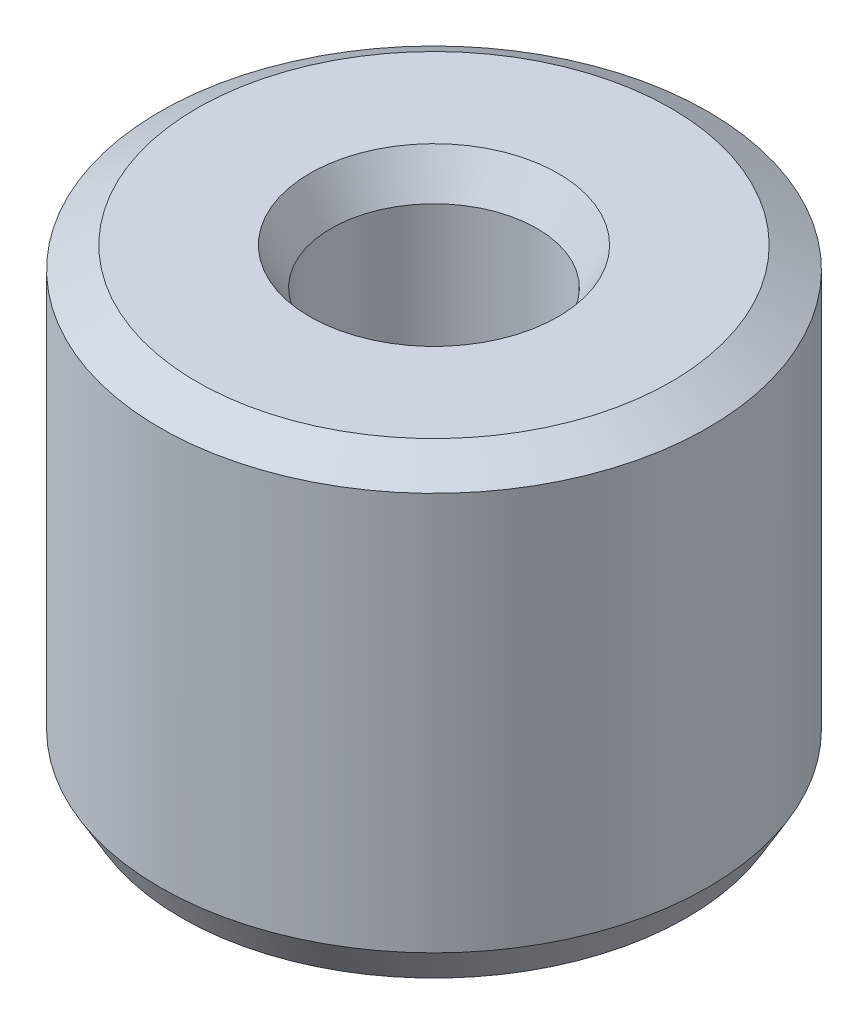
ISO-10303-21;
HEADER;
FILE_DESCRIPTION(('STEP AP214'),'2;1');
FILE_NAME('part.step','',(''),(''),'','','');
FILE_SCHEMA(('AUTOMOTIVE_DESIGN { 1 0 10303 214 1 1 1 1 }'));
ENDSEC;
DATA;
#1=APPLICATION_CONTEXT('core data for automotive mechanical design processes');
#2=APPLICATION_PROTOCOL_DEFINITION('international standard','automotive_design',2000,#1);
#3=PRODUCT_CONTEXT('',#1,'mechanical');
#4=PRODUCT('Part','Part','',(#3));
#5=PRODUCT_RELATED_PRODUCT_CATEGORY('part','',(#4));
#6=PRODUCT_DEFINITION_FORMATION('','',#4);
#7=PRODUCT_DEFINITION_CONTEXT('part definition',#1,'design');
#8=PRODUCT_DEFINITION('design','',#6,#7);
#9=PRODUCT_DEFINITION_SHAPE('','',#8);
#10=(LENGTH_UNIT() NAMED_UNIT(*) SI_UNIT(.MILLI.,.METRE.));
#11=(NAMED_UNIT(*) PLANE_ANGLE_UNIT() SI_UNIT($,.RADIAN.));
#12=(NAMED_UNIT(*) SI_UNIT($,.STERADIAN.) SOLID_ANGLE_UNIT());
#13=UNCERTAINTY_MEASURE_WITH_UNIT(LENGTH_MEASURE(1.E-05),#10,'distance_accuracy_value','');
#14=(GEOMETRIC_REPRESENTATION_CONTEXT(3) GLOBAL_UNCERTAINTY_ASSIGNED_CONTEXT((#13)) GLOBAL_UNIT_ASSIGNED_CONTEXT((#10,
#11,#12)) REPRESENTATION_CONTEXT('',''));
#15=CARTESIAN_POINT('',(0.,0.,0.));
#16=DIRECTION('',(0.,0.,1.));
#17=DIRECTION('',(1.,0.,0.));
#18=AXIS2_PLACEMENT_3D('',#15,#16,#17);
#19=CARTESIAN_POINT('',(0.,37.4681303338492,0.));
#20=DIRECTION('',(0.,-1.,0.));
#21=DIRECTION('',(0.,0.,-1.));
#22=AXIS2_PLACEMENT_3D('',#19,#20,#21);
#23=CYLINDRICAL_SURFACE('',#22,22.5);
#24=CARTESIAN_POINT('',(0.,3.03370017799263,0.));
#25=DIRECTION('',(0.,1.,0.));
#26=DIRECTION('',(0.,0.,1.));
#27=AXIS2_PLACEMENT_3D('',#24,#25,#26);
#28=CIRCLE('',#27,22.5);
#29=CARTESIAN_POINT('',(0.,3.03370017799263,22.5));
#30=VERTEX_POINT('',#29);
#31=EDGE_CURVE('E10',#30,#30,#28,.T.);
#32=ORIENTED_EDGE('',*,*,#31,.T.);
#33=EDGE_LOOP('',(#32));
#34=FACE_BOUND('',#33,.T.);
#35=CARTESIAN_POINT('',(0.,35.7166227194445,0.));
#36=DIRECTION('',(0.,1.,0.));
#37=DIRECTION('',(0.,0.,1.));
#38=AXIS2_PLACEMENT_3D('',#35,#36,#37);
#39=CIRCLE('',#38,22.5);
#40=CARTESIAN_POINT('',(0.,35.7166227194445,-22.5));
#41=VERTEX_POINT('',#40);
#42=EDGE_CURVE('E50',#41,#41,#39,.F.);
#43=ORIENTED_EDGE('',*,*,#42,.T.);
#44=EDGE_LOOP('',(#43));
#45=FACE_BOUND('',#44,.T.);
#46=ADVANCED_FACE('F39',(#34,#45),#23,.T.);
#47=CARTESIAN_POINT('',(0.,37.4681303338492,0.));
#48=DIRECTION('',(0.,1.,0.));
#49=DIRECTION('',(0.,0.,1.));
#50=AXIS2_PLACEMENT_3D('',#47,#48,#49);
#51=PLANE('',#50);
#52=CARTESIAN_POINT('',(0.,37.4681303338492,0.));
#53=DIRECTION('',(0.,1.,0.));
#54=DIRECTION('',(0.,0.,1.));
#55=AXIS2_PLACEMENT_3D('',#52,#53,#54);
#56=CIRCLE('',#55,10.1991806157269);
#57=CARTESIAN_POINT('',(0.,37.4681303338492,10.1991806157269));
#58=VERTEX_POINT('',#57);
#59=EDGE_CURVE('E58',#58,#58,#56,.F.);
#60=ORIENTED_EDGE('',*,*,#59,.T.);
#61=EDGE_LOOP('',(#60));
#62=FACE_BOUND('',#61,.T.);
#63=CARTESIAN_POINT('',(0.,37.4681303338492,0.));
#64=DIRECTION('',(0.,1.,0.));
#65=DIRECTION('',(0.,0.,1.));
#66=AXIS2_PLACEMENT_3D('',#63,#64,#65);
#67=CIRCLE('',#66,19.4662998220074);
#68=CARTESIAN_POINT('',(0.,37.4681303338492,-19.4662998220074));
#69=VERTEX_POINT('',#68);
#70=EDGE_CURVE('E61',#69,#69,#67,.T.);
#71=ORIENTED_EDGE('',*,*,#70,.T.);
#72=EDGE_LOOP('',(#71));
#73=FACE_BOUND('',#72,.T.);
#74=ADVANCED_FACE('F88',(#62,#73),#51,.T.);
#75=CARTESIAN_POINT('',(0.,0.,0.));
#76=DIRECTION('',(0.,1.,0.));
#77=DIRECTION('',(0.,0.,1.));
#78=AXIS2_PLACEMENT_3D('',#75,#76,#77);
#79=PLANE('',#78);
#80=CARTESIAN_POINT('',(0.,0.,0.));
#81=DIRECTION('',(0.,1.,0.));
#82=DIRECTION('',(0.,0.,1.));
#83=AXIS2_PLACEMENT_3D('',#80,#81,#82);
#84=CIRCLE('',#83,11.4813731793148);
#85=CARTESIAN_POINT('',(0.,0.,-11.4813731793148));
#86=VERTEX_POINT('',#85);
#87=EDGE_CURVE('E51',#86,#86,#84,.T.);
#88=ORIENTED_EDGE('',*,*,#87,.T.);
#89=EDGE_LOOP('',(#88));
#90=FACE_BOUND('',#89,.T.);
#91=CARTESIAN_POINT('',(0.,0.,0.));
#92=DIRECTION('',(0.,1.,0.));
#93=DIRECTION('',(0.,0.,1.));
#94=AXIS2_PLACEMENT_3D('',#91,#92,#93);
#95=CIRCLE('',#94,20.7484923855953);
#96=CARTESIAN_POINT('',(0.,0.,20.7484923855953));
#97=VERTEX_POINT('',#96);
#98=EDGE_CURVE('E54',#97,#97,#95,.F.);
#99=ORIENTED_EDGE('',*,*,#98,.T.);
#100=EDGE_LOOP('',(#99));
#101=FACE_BOUND('',#100,.T.);
#102=ADVANCED_FACE('F83',(#90,#101),#79,.F.);
#103=CARTESIAN_POINT('',(0.,37.4681303338492,0.));
#104=DIRECTION('',(0.,-1.,0.));
#105=DIRECTION('',(0.,0.,-1.));
#106=AXIS2_PLACEMENT_3D('',#103,#104,#105);
#107=CYLINDRICAL_SURFACE('',#106,8.4476730013222);
#108=CARTESIAN_POINT('',(0.,34.4344301558566,0.));
#109=DIRECTION('',(0.,1.,0.));
#110=DIRECTION('',(0.,0.,1.));
#111=AXIS2_PLACEMENT_3D('',#108,#109,#110);
#112=CIRCLE('',#111,8.4476730013222);
#113=CARTESIAN_POINT('',(0.,34.4344301558566,8.4476730013222));
#114=VERTEX_POINT('',#113);
#115=EDGE_CURVE('E67',#114,#114,#112,.T.);
#116=ORIENTED_EDGE('',*,*,#115,.T.);
#117=EDGE_LOOP('',(#116));
#118=FACE_BOUND('',#117,.T.);
#119=CARTESIAN_POINT('',(0.,1.75150761440468,0.));
#120=DIRECTION('',(0.,1.,0.));
#121=DIRECTION('',(0.,0.,1.));
#122=AXIS2_PLACEMENT_3D('',#119,#120,#121);
#123=CIRCLE('',#122,8.4476730013222);
#124=CARTESIAN_POINT('',(0.,1.75150761440468,-8.4476730013222));
#125=VERTEX_POINT('',#124);
#126=EDGE_CURVE('E69',#125,#125,#123,.F.);
#127=ORIENTED_EDGE('',*,*,#126,.T.);
#128=EDGE_LOOP('',(#127));
#129=FACE_BOUND('',#128,.T.);
#130=ADVANCED_FACE('F71',(#118,#129),#107,.F.);
#131=CARTESIAN_POINT('',(0.,34.4344301558566,0.));
#132=DIRECTION('',(0.,1.,0.));
#133=DIRECTION('',(0.,0.,1.));
#134=AXIS2_PLACEMENT_3D('',#131,#132,#133);
#135=CONICAL_SURFACE('',#134,8.4476730013222,0.523598775598302);
#136=ORIENTED_EDGE('',*,*,#59,.F.);
#137=EDGE_LOOP('',(#136));
#138=FACE_BOUND('',#137,.T.);
#139=ORIENTED_EDGE('',*,*,#115,.F.);
#140=EDGE_LOOP('',(#139));
#141=FACE_BOUND('',#140,.T.);
#142=ADVANCED_FACE('F77',(#138,#141),#135,.F.);
#143=CARTESIAN_POINT('',(0.,0.,0.));
#144=DIRECTION('',(0.,-1.,0.));
#145=DIRECTION('',(0.,0.,-1.));
#146=AXIS2_PLACEMENT_3D('',#143,#144,#145);
#147=CONICAL_SURFACE('',#146,11.4813731793148,1.04719755119659);
#148=CARTESIAN_POINT('',(0.,1.75150761440468,-8.4476730013222));
#149=CARTESIAN_POINT('',(0.,1.7332627434213,-8.47927404484296));
#150=CARTESIAN_POINT('',(0.,1.71501787243792,-8.51087508836371));
#151=CARTESIAN_POINT('',(0.,1.67852813047115,-8.57407717540523));
#152=CARTESIAN_POINT('',(0.,1.66028325948777,-8.60567821892598));
#153=CARTESIAN_POINT('',(0.,1.623793517521,-8.6688803059675));
#154=CARTESIAN_POINT('',(0.,1.60554864653762,-8.70048134948825));
#155=CARTESIAN_POINT('',(0.,1.56905890457086,-8.76368343652977));
#156=CARTESIAN_POINT('',(0.,1.55081403358748,-8.79528448005052));
#157=CARTESIAN_POINT('',(0.,1.51432429162071,-8.85848656709203));
#158=CARTESIAN_POINT('',(0.,1.49607942063733,-8.89008761061279));
#159=CARTESIAN_POINT('',(0.,1.45958967867057,-8.95328969765431));
#160=CARTESIAN_POINT('',(0.,1.44134480768718,-8.98489074117506));
#161=CARTESIAN_POINT('',(0.,1.40485506572042,-9.04809282821657));
#162=CARTESIAN_POINT('',(0.,1.38661019473704,-9.07969387173733));
#163=CARTESIAN_POINT('',(0.,1.35012045277027,-9.14289595877884));
#164=CARTESIAN_POINT('',(0.,1.33187558178689,-9.1744970022996));
#165=CARTESIAN_POINT('',(0.,1.29538583982013,-9.23769908934112));
#166=CARTESIAN_POINT('',(0.,1.27714096883675,-9.26930013286187));
#167=CARTESIAN_POINT('',(0.,1.24065122686998,-9.33250221990338));
#168=CARTESIAN_POINT('',(0.,1.2224063558866,-9.36410326342414));
#169=CARTESIAN_POINT('',(0.,1.18591661391983,-9.42730535046565));
#170=CARTESIAN_POINT('',(0.,1.16767174293645,-9.45890639398641));
#171=CARTESIAN_POINT('',(0.,1.13118200096969,-9.52210848102792));
#172=CARTESIAN_POINT('',(0.,1.11293712998631,-9.55370952454868));
#173=CARTESIAN_POINT('',(0.,1.07644738801954,-9.61691161159019));
#174=CARTESIAN_POINT('',(0.,1.05820251703616,-9.64851265511095));
#175=CARTESIAN_POINT('',(0.,1.0217127750694,-9.71171474215246));
#176=CARTESIAN_POINT('',(0.,1.00346790408601,-9.74331578567322));
#177=CARTESIAN_POINT('',(0.,0.96697816211925,-9.80651787271473));
#178=CARTESIAN_POINT('',(0.,0.948733291135868,-9.83811891623549));
#179=CARTESIAN_POINT('',(0.,0.912243549169104,-9.901321003277));
#180=CARTESIAN_POINT('',(0.,0.893998678185722,-9.93292204679776));
#181=CARTESIAN_POINT('',(0.,0.857508936218958,-9.99612413383927));
#182=CARTESIAN_POINT('',(0.,0.839264065235575,-10.02772517736));
#183=CARTESIAN_POINT('',(0.,0.802774323268811,-10.0909272644015));
#184=CARTESIAN_POINT('',(0.,0.784529452285429,-10.1225283079223));
#185=CARTESIAN_POINT('',(0.,0.748039710318665,-10.1857303949638));
#186=CARTESIAN_POINT('',(0.,0.729794839335283,-10.2173314384846));
#187=CARTESIAN_POINT('',(0.,0.693305097368519,-10.2805335255261));
#188=CARTESIAN_POINT('',(0.,0.675060226385137,-10.3121345690468));
#189=CARTESIAN_POINT('',(0.,0.638570484418373,-10.3753366560884));
#190=CARTESIAN_POINT('',(0.,0.620325613434991,-10.4069376996091));
#191=CARTESIAN_POINT('',(0.,0.583835871468226,-10.4701397866506));
#192=CARTESIAN_POINT('',(0.,0.565591000484844,-10.5017408301714));
#193=CARTESIAN_POINT('',(0.,0.52910125851808,-10.5649429172129));
#194=CARTESIAN_POINT('',(0.,0.510856387534698,-10.5965439607336));
#195=CARTESIAN_POINT('',(0.,0.474366645567934,-10.6597460477752));
#196=CARTESIAN_POINT('',(0.,0.456121774584552,-10.6913470912959));
#197=CARTESIAN_POINT('',(0.,0.419632032617788,-10.7545491783374));
#198=CARTESIAN_POINT('',(0.,0.401387161634406,-10.7861502218582));
#199=CARTESIAN_POINT('',(0.,0.364897419667641,-10.8493523088997));
#200=CARTESIAN_POINT('',(0.,0.346652548684259,-10.8809533524205));
#201=CARTESIAN_POINT('',(0.,0.310162806717495,-10.944155439462));
#202=CARTESIAN_POINT('',(0.,0.291917935734113,-10.9757564829827));
#203=CARTESIAN_POINT('',(0.,0.255428193767349,-11.0389585700242));
#204=CARTESIAN_POINT('',(0.,0.237183322783967,-11.070559613545));
#205=CARTESIAN_POINT('',(0.,0.200693580817203,-11.1337617005865));
#206=CARTESIAN_POINT('',(0.,0.182448709833821,-11.1653627441073));
#207=CARTESIAN_POINT('',(0.,0.145958967867057,-11.2285648311488));
#208=CARTESIAN_POINT('',(0.,0.127714096883675,-11.2601658746695));
#209=CARTESIAN_POINT('',(0.,0.0912243549169105,-11.323367961711));
#210=CARTESIAN_POINT('',(0.,0.0729794839335283,-11.3549690052318));
#211=CARTESIAN_POINT('',(0.,0.0364897419667639,-11.4181710922733));
#212=CARTESIAN_POINT('',(0.,0.0182448709833817,-11.4497721357941));
#213=CARTESIAN_POINT('',(0.,0.,-11.4813731793148));
#214=B_SPLINE_CURVE_WITH_KNOTS('',3,(#148,#149,#150,#151,#152,#153,#154,#155,#156,#157,#158,
#159,#160,#161,#162,#163,#164,#165,#166,#167,#168,#169,#170,#171,#172,#173,#174,#175,#176,#177,
#178,#179,#180,#181,#182,#183,#184,#185,#186,#187,#188,#189,#190,#191,#192,#193,#194,#195,#196,
#197,#198,#199,#200,#201,#202,#203,#204,#205,#206,#207,#208,#209,#210,#211,#212,#213),
.UNSPECIFIED.,.F.,.F.,(4,2,2,2,2,2,2,2,2,2,2,2,2,2,2,2,2,2,2,2,2,2,2,2,2,2,2,2,2,2,2,2,4),(0.,
0.109469225900292,0.218938451800583,0.328407677700875,0.437876903601167,0.547346129501457,
0.65681535540175,0.76628458130204,0.875753807202332,0.985223033102624,1.09469225900292,
1.20416148490321,1.3136307108035,1.42309993670379,1.53256916260408,1.64203838850437,
1.75150761440467,1.86097684030496,1.97044606620525,2.07991529210554,2.18938451800583,
2.29885374390612,2.40832296980641,2.51779219570671,2.627261421607,2.73673064750729,
2.84619987340758,2.95566909930787,3.06513832520816,3.17460755110846,3.28407677700875,
3.39354600290904,3.50301522880933),.UNSPECIFIED.);
#215=EDGE_CURVE('BSEAM73',#125,#86,#214,.T.);
#216=ORIENTED_EDGE('',*,*,#126,.F.);
#217=ORIENTED_EDGE('',*,*,#87,.F.);
#218=ORIENTED_EDGE('',*,*,#215,.T.);
#219=ORIENTED_EDGE('',*,*,#215,.F.);
#220=EDGE_LOOP('',(#216,#218,#217,#219));
#221=FACE_BOUND('',#220,.T.);
#222=ADVANCED_FACE('F73',(#221),#147,.F.);
#223=CARTESIAN_POINT('',(0.,3.03370017799263,0.));
#224=DIRECTION('',(0.,1.,0.));
#225=DIRECTION('',(0.,0.,1.));
#226=AXIS2_PLACEMENT_3D('',#223,#224,#225);
#227=CONICAL_SURFACE('',#226,22.5,0.523598775598303);
#228=ORIENTED_EDGE('',*,*,#98,.F.);
#229=EDGE_LOOP('',(#228));
#230=FACE_BOUND('',#229,.T.);
#231=ORIENTED_EDGE('',*,*,#31,.F.);
#232=EDGE_LOOP('',(#231));
#233=FACE_BOUND('',#232,.T.);
#234=ADVANCED_FACE('F76',(#230,#233),#227,.T.);
#235=CARTESIAN_POINT('',(0.,37.4681303338492,0.));
#236=DIRECTION('',(0.,-1.,0.));
#237=DIRECTION('',(0.,0.,-1.));
#238=AXIS2_PLACEMENT_3D('',#235,#236,#237);
#239=CONICAL_SURFACE('',#238,19.4662998220074,1.04719755119659);
#240=CARTESIAN_POINT('',(0.,35.7166227194445,-22.5));
#241=CARTESIAN_POINT('',(0.,35.7348675904279,-22.4683989564793));
#242=CARTESIAN_POINT('',(0.,35.7531124614113,-22.4367979129585));
#243=CARTESIAN_POINT('',(0.,35.7896022033781,-22.373595825917));
#244=CARTESIAN_POINT('',(0.,35.8078470743614,-22.3419947823962));
#245=CARTESIAN_POINT('',(0.,35.8443368163282,-22.2787926953547));
#246=CARTESIAN_POINT('',(0.,35.8625816873116,-22.247191651834));
#247=CARTESIAN_POINT('',(0.,35.8990714292784,-22.1839895647924));
#248=CARTESIAN_POINT('',(0.,35.9173163002617,-22.1523885212717));
#249=CARTESIAN_POINT('',(0.,35.9538060422285,-22.0891864342302));
#250=CARTESIAN_POINT('',(0.,35.9720509132119,-22.0575853907094));
#251=CARTESIAN_POINT('',(0.,36.0085406551786,-21.9943833036679));
#252=CARTESIAN_POINT('',(0.,36.026785526162,-21.9627822601471));
#253=CARTESIAN_POINT('',(0.,36.0632752681288,-21.8995801731056));
#254=CARTESIAN_POINT('',(0.,36.0815201391122,-21.8679791295849));
#255=CARTESIAN_POINT('',(0.,36.1180098810789,-21.8047770425434));
#256=CARTESIAN_POINT('',(0.,36.1362547520623,-21.7731759990226));
#257=CARTESIAN_POINT('',(0.,36.1727444940291,-21.7099739119811));
#258=CARTESIAN_POINT('',(0.,36.1909893650125,-21.6783728684603));
#259=CARTESIAN_POINT('',(0.,36.2274791069792,-21.6151707814188));
#260=CARTESIAN_POINT('',(0.,36.2457239779626,-21.5835697378981));
#261=CARTESIAN_POINT('',(0.,36.2822137199294,-21.5203676508566));
#262=CARTESIAN_POINT('',(0.,36.3004585909128,-21.4887666073358));
#263=CARTESIAN_POINT('',(0.,36.3369483328795,-21.4255645202943));
#264=CARTESIAN_POINT('',(0.,36.3551932038629,-21.3939634767735));
#265=CARTESIAN_POINT('',(0.,36.3916829458297,-21.330761389732));
#266=CARTESIAN_POINT('',(0.,36.4099278168131,-21.2991603462113));
#267=CARTESIAN_POINT('',(0.,36.4464175587798,-21.2359582591697));
#268=CARTESIAN_POINT('',(0.,36.4646624297632,-21.204357215649));
#269=CARTESIAN_POINT('',(0.,36.50115217173,-21.1411551286075));
#270=CARTESIAN_POINT('',(0.,36.5193970427133,-21.1095540850867));
#271=CARTESIAN_POINT('',(0.,36.5558867846801,-21.0463519980452));
#272=CARTESIAN_POINT('',(0.,36.5741316556635,-21.0147509545244));
#273=CARTESIAN_POINT('',(0.,36.6106213976303,-20.9515488674829));
#274=CARTESIAN_POINT('',(0.,36.6288662686136,-20.9199478239622));
#275=CARTESIAN_POINT('',(0.,36.6653560105804,-20.8567457369207));
#276=CARTESIAN_POINT('',(0.,36.6836008815638,-20.8251446933999));
#277=CARTESIAN_POINT('',(0.,36.7200906235305,-20.7619426063584));
#278=CARTESIAN_POINT('',(0.,36.7383354945139,-20.7303415628376));
#279=CARTESIAN_POINT('',(0.,36.7748252364807,-20.6671394757961));
#280=CARTESIAN_POINT('',(0.,36.7930701074641,-20.6355384322754));
#281=CARTESIAN_POINT('',(0.,36.8295598494308,-20.5723363452339));
#282=CARTESIAN_POINT('',(0.,36.8478047204142,-20.5407353017131));
#283=CARTESIAN_POINT('',(0.,36.884294462381,-20.4775332146716));
#284=CARTESIAN_POINT('',(0.,36.9025393333644,-20.4459321711508));
#285=CARTESIAN_POINT('',(0.,36.9390290753311,-20.3827300841093));
#286=CARTESIAN_POINT('',(0.,36.9572739463145,-20.3511290405886));
#287=CARTESIAN_POINT('',(0.,36.9937636882813,-20.287926953547));
#288=CARTESIAN_POINT('',(0.,37.0120085592647,-20.2563259100263));
#289=CARTESIAN_POINT('',(0.,37.0484983012314,-20.1931238229848));
#290=CARTESIAN_POINT('',(0.,37.0667431722148,-20.161522779464));
#291=CARTESIAN_POINT('',(0.,37.1032329141816,-20.0983206924225));
#292=CARTESIAN_POINT('',(0.,37.121477785165,-20.0667196489018));
#293=CARTESIAN_POINT('',(0.,37.1579675271317,-20.0035175618602));
#294=CARTESIAN_POINT('',(0.,37.1762123981151,-19.9719165183395));
#295=CARTESIAN_POINT('',(0.,37.2127021400819,-19.908714431298));
#296=CARTESIAN_POINT('',(0.,37.2309470110652,-19.8771133877772));
#297=CARTESIAN_POINT('',(0.,37.267436753032,-19.8139113007357));
#298=CARTESIAN_POINT('',(0.,37.2856816240154,-19.7823102572149));
#299=CARTESIAN_POINT('',(0.,37.3221713659822,-19.7191081701734));
#300=CARTESIAN_POINT('',(0.,37.3404162369655,-19.6875071266527));
#301=CARTESIAN_POINT('',(0.,37.3769059789323,-19.6243050396112));
#302=CARTESIAN_POINT('',(0.,37.3951508499157,-19.5927039960904));
#303=CARTESIAN_POINT('',(0.,37.4316405918824,-19.5295019090489));
#304=CARTESIAN_POINT('',(0.,37.4498854628658,-19.4979008655281));
#305=CARTESIAN_POINT('',(0.,37.4681303338492,-19.4662998220074));
#306=B_SPLINE_CURVE_WITH_KNOTS('',3,(#240,#241,#242,#243,#244,#245,#246,#247,#248,#249,#250,
#251,#252,#253,#254,#255,#256,#257,#258,#259,#260,#261,#262,#263,#264,#265,#266,#267,#268,#269,
#270,#271,#272,#273,#274,#275,#276,#277,#278,#279,#280,#281,#282,#283,#284,#285,#286,#287,#288,
#289,#290,#291,#292,#293,#294,#295,#296,#297,#298,#299,#300,#301,#302,#303,#304,#305),
.UNSPECIFIED.,.F.,.F.,(4,2,2,2,2,2,2,2,2,2,2,2,2,2,2,2,2,2,2,2,2,2,2,2,2,2,2,2,2,2,2,2,4),(0.,
0.109469225900294,0.218938451800584,0.328407677700878,0.437876903601165,0.547346129501459,
0.65681535540175,0.766284581302043,0.875753807202334,0.985223033102627,1.09469225900292,
1.20416148490321,1.3136307108035,1.42309993670379,1.53256916260408,1.64203838850438,
1.75150761440467,1.86097684030496,1.97044606620525,2.07991529210554,2.18938451800583,
2.29885374390613,2.40832296980642,2.51779219570671,2.627261421607,2.73673064750729,
2.84619987340758,2.95566909930788,3.06513832520817,3.17460755110846,3.28407677700875,
3.39354600290904,3.50301522880933),.UNSPECIFIED.);
#307=EDGE_CURVE('BSEAM45',#41,#69,#306,.T.);
#308=ORIENTED_EDGE('',*,*,#42,.F.);
#309=ORIENTED_EDGE('',*,*,#70,.F.);
#310=ORIENTED_EDGE('',*,*,#307,.T.);
#311=ORIENTED_EDGE('',*,*,#307,.F.);
#312=EDGE_LOOP('',(#308,#310,#309,#311));
#313=FACE_BOUND('',#312,.T.);
#314=ADVANCED_FACE('F45',(#313),#239,.T.);
#315=CLOSED_SHELL('',(#46,#74,#102,#130,#142,#222,#234,#314));
#316=MANIFOLD_SOLID_BREP('B2',#315);
#317=ADVANCED_BREP_SHAPE_REPRESENTATION('',(#18,#316),#14);
#318=SHAPE_DEFINITION_REPRESENTATION(#9,#317);
ENDSEC;
END-ISO-10303-21;
